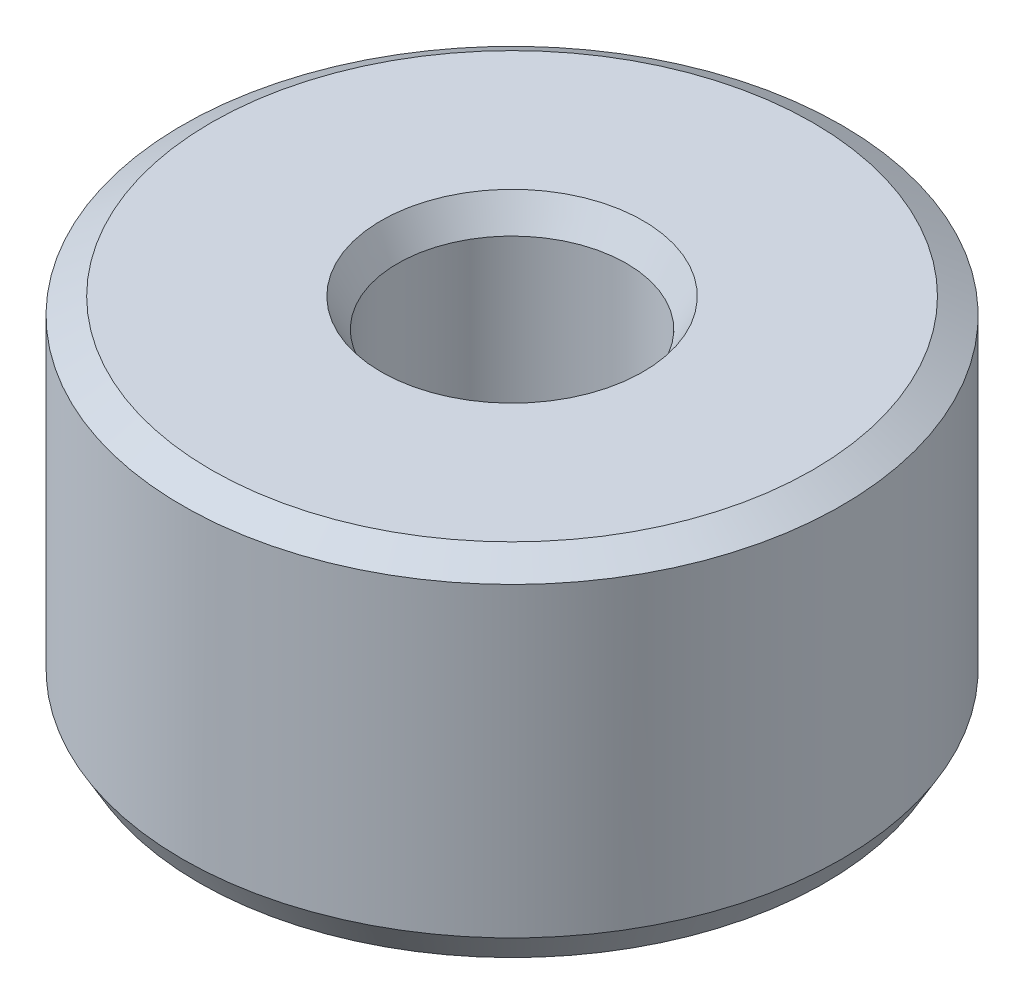
ISO-10303-21;
HEADER;
FILE_DESCRIPTION(('STEP AP214'),'2;1');
FILE_NAME('part.step','',(''),(''),'','','');
FILE_SCHEMA(('AUTOMOTIVE_DESIGN { 1 0 10303 214 1 1 1 1 }'));
ENDSEC;
DATA;
#1=APPLICATION_CONTEXT('core data for automotive mechanical design processes');
#2=APPLICATION_PROTOCOL_DEFINITION('international standard','automotive_design',2000,#1);
#3=PRODUCT_CONTEXT('',#1,'mechanical');
#4=PRODUCT('Part','Part','',(#3));
#5=PRODUCT_RELATED_PRODUCT_CATEGORY('part','',(#4));
#6=PRODUCT_DEFINITION_FORMATION('','',#4);
#7=PRODUCT_DEFINITION_CONTEXT('part definition',#1,'design');
#8=PRODUCT_DEFINITION('design','',#6,#7);
#9=PRODUCT_DEFINITION_SHAPE('','',#8);
#10=(LENGTH_UNIT() NAMED_UNIT(*) SI_UNIT(.MILLI.,.METRE.));
#11=(NAMED_UNIT(*) PLANE_ANGLE_UNIT() SI_UNIT($,.RADIAN.));
#12=(NAMED_UNIT(*) SI_UNIT($,.STERADIAN.) SOLID_ANGLE_UNIT());
#13=UNCERTAINTY_MEASURE_WITH_UNIT(LENGTH_MEASURE(1.E-05),#10,'distance_accuracy_value','');
#14=(GEOMETRIC_REPRESENTATION_CONTEXT(3) GLOBAL_UNCERTAINTY_ASSIGNED_CONTEXT((#13)) GLOBAL_UNIT_ASSIGNED_CONTEXT((#10,
#11,#12)) REPRESENTATION_CONTEXT('',''));
#15=CARTESIAN_POINT('',(0.,0.,0.));
#16=DIRECTION('',(0.,0.,1.));
#17=DIRECTION('',(1.,0.,0.));
#18=AXIS2_PLACEMENT_3D('',#15,#16,#17);
#19=CARTESIAN_POINT('',(0.,13.3304831460371,0.));
#20=DIRECTION('',(0.,-1.,0.));
#21=DIRECTION('',(0.,0.,-1.));
#22=AXIS2_PLACEMENT_3D('',#19,#20,#21);
#23=CYLINDRICAL_SURFACE('',#22,12.5);
#24=CARTESIAN_POINT('',(0.,1.09053149015088,0.));
#25=DIRECTION('',(0.,1.,0.));
#26=DIRECTION('',(0.,0.,1.));
#27=AXIS2_PLACEMENT_3D('',#24,#25,#26);
#28=CIRCLE('',#27,12.5);
#29=CARTESIAN_POINT('',(0.,1.09053149015088,-12.5));
#30=VERTEX_POINT('',#29);
#31=EDGE_CURVE('E10',#30,#30,#28,.T.);
#32=CARTESIAN_POINT('',(0.,12.7008644966388,0.));
#33=DIRECTION('',(0.,1.,0.));
#34=DIRECTION('',(0.,0.,1.));
#35=AXIS2_PLACEMENT_3D('',#32,#33,#34);
#36=CIRCLE('',#35,12.5);
#37=CARTESIAN_POINT('',(0.,12.7008644966388,-12.5));
#38=VERTEX_POINT('',#37);
#39=EDGE_CURVE('E50',#38,#38,#36,.F.);
#40=CARTESIAN_POINT('',(0.,1.09053149015088,-12.5));
#41=CARTESIAN_POINT('',(0.,1.21147245896847,-12.5));
#42=CARTESIAN_POINT('',(0.,1.33241342778605,-12.5));
#43=CARTESIAN_POINT('',(0.,1.57429536542121,-12.5));
#44=CARTESIAN_POINT('',(0.,1.69523633423879,-12.5));
#45=CARTESIAN_POINT('',(0.,1.93711827187396,-12.5));
#46=CARTESIAN_POINT('',(0.,2.05805924069154,-12.5));
#47=CARTESIAN_POINT('',(0.,2.2999411783267,-12.5));
#48=CARTESIAN_POINT('',(0.,2.42088214714429,-12.5));
#49=CARTESIAN_POINT('',(0.,2.66276408477945,-12.5));
#50=CARTESIAN_POINT('',(0.,2.78370505359703,-12.5));
#51=CARTESIAN_POINT('',(0.,3.0255869912322,-12.5));
#52=CARTESIAN_POINT('',(0.,3.14652796004978,-12.5));
#53=CARTESIAN_POINT('',(0.,3.38840989768494,-12.5));
#54=CARTESIAN_POINT('',(0.,3.50935086650253,-12.5));
#55=CARTESIAN_POINT('',(0.,3.75123280413769,-12.5));
#56=CARTESIAN_POINT('',(0.,3.87217377295527,-12.5));
#57=CARTESIAN_POINT('',(0.,4.11405571059044,-12.5));
#58=CARTESIAN_POINT('',(0.,4.23499667940802,-12.5));
#59=CARTESIAN_POINT('',(0.,4.47687861704318,-12.5));
#60=CARTESIAN_POINT('',(0.,4.59781958586076,-12.5));
#61=CARTESIAN_POINT('',(0.,4.83970152349593,-12.5));
#62=CARTESIAN_POINT('',(0.,4.96064249231351,-12.5));
#63=CARTESIAN_POINT('',(0.,5.20252442994867,-12.5));
#64=CARTESIAN_POINT('',(0.,5.32346539876626,-12.5));
#65=CARTESIAN_POINT('',(0.,5.56534733640142,-12.5));
#66=CARTESIAN_POINT('',(0.,5.686288305219,-12.5));
#67=CARTESIAN_POINT('',(0.,5.92817024285416,-12.5));
#68=CARTESIAN_POINT('',(0.,6.04911121167175,-12.5));
#69=CARTESIAN_POINT('',(0.,6.29099314930691,-12.5));
#70=CARTESIAN_POINT('',(0.,6.41193411812449,-12.5));
#71=CARTESIAN_POINT('',(0.,6.65381605575966,-12.5));
#72=CARTESIAN_POINT('',(0.,6.77475702457724,-12.5));
#73=CARTESIAN_POINT('',(0.,7.0166389622124,-12.5));
#74=CARTESIAN_POINT('',(0.,7.13757993102999,-12.5));
#75=CARTESIAN_POINT('',(0.,7.37946186866515,-12.5));
#76=CARTESIAN_POINT('',(0.,7.50040283748273,-12.5));
#77=CARTESIAN_POINT('',(0.,7.7422847751179,-12.5));
#78=CARTESIAN_POINT('',(0.,7.86322574393548,-12.5));
#79=CARTESIAN_POINT('',(0.,8.10510768157064,-12.5));
#80=CARTESIAN_POINT('',(0.,8.22604865038822,-12.5));
#81=CARTESIAN_POINT('',(0.,8.46793058802339,-12.5));
#82=CARTESIAN_POINT('',(0.,8.58887155684097,-12.5));
#83=CARTESIAN_POINT('',(0.,8.83075349447613,-12.5));
#84=CARTESIAN_POINT('',(0.,8.95169446329372,-12.5));
#85=CARTESIAN_POINT('',(0.,9.19357640092888,-12.5));
#86=CARTESIAN_POINT('',(0.,9.31451736974646,-12.5));
#87=CARTESIAN_POINT('',(0.,9.55639930738162,-12.5));
#88=CARTESIAN_POINT('',(0.,9.67734027619921,-12.5));
#89=CARTESIAN_POINT('',(0.,9.91922221383437,-12.5));
#90=CARTESIAN_POINT('',(0.,10.040163182652,-12.5));
#91=CARTESIAN_POINT('',(0.,10.2820451202871,-12.5));
#92=CARTESIAN_POINT('',(0.,10.4029860891047,-12.5));
#93=CARTESIAN_POINT('',(0.,10.6448680267399,-12.5));
#94=CARTESIAN_POINT('',(0.,10.7658089955574,-12.5));
#95=CARTESIAN_POINT('',(0.,11.0076909331926,-12.5));
#96=CARTESIAN_POINT('',(0.,11.1286319020102,-12.5));
#97=CARTESIAN_POINT('',(0.,11.3705138396454,-12.5));
#98=CARTESIAN_POINT('',(0.,11.4914548084629,-12.5));
#99=CARTESIAN_POINT('',(0.,11.7333367460981,-12.5));
#100=CARTESIAN_POINT('',(0.,11.8542777149157,-12.5));
#101=CARTESIAN_POINT('',(0.,12.0961596525508,-12.5));
#102=CARTESIAN_POINT('',(0.,12.2171006213684,-12.5));
#103=CARTESIAN_POINT('',(0.,12.4589825590036,-12.5));
#104=CARTESIAN_POINT('',(0.,12.5799235278212,-12.5));
#105=CARTESIAN_POINT('',(0.,12.7008644966388,-12.5));
#106=B_SPLINE_CURVE_WITH_KNOTS('',3,(#40,#41,#42,#43,#44,#45,#46,#47,#48,#49,#50,#51,#52,#53,
#54,#55,#56,#57,#58,#59,#60,#61,#62,#63,#64,#65,#66,#67,#68,#69,#70,#71,#72,#73,#74,#75,#76,#77,
#78,#79,#80,#81,#82,#83,#84,#85,#86,#87,#88,#89,#90,#91,#92,#93,#94,#95,#96,#97,#98,#99,#100,
#101,#102,#103,#104,#105),.UNSPECIFIED.,.F.,.F.,(4,2,2,2,2,2,2,2,2,2,2,2,2,2,2,2,2,2,2,2,2,2,2,
2,2,2,2,2,2,2,2,2,4),(0.,0.362822906452747,0.725645812905492,1.08846871935824,1.45129162581098,
1.81411453226373,2.17693743871648,2.53976034516922,2.90258325162197,3.26540615807472,
3.62822906452746,3.99105197098021,4.35387487743295,4.7166977838857,5.07952069033844,
5.44234359679119,5.80516650324394,6.16798940969668,6.53081231614943,6.89363522260217,
7.25645812905492,7.61928103550767,7.98210394196041,8.34492684841316,8.7077497548659,
9.07057266131865,9.4333955677714,9.79621847422415,10.1590413806769,10.5218642871296,
10.8846871935824,11.2475101000351,11.6103330064879),.UNSPECIFIED.);
#107=EDGE_CURVE('BSEAM39',#30,#38,#106,.T.);
#108=ORIENTED_EDGE('',*,*,#31,.T.);
#109=ORIENTED_EDGE('',*,*,#39,.T.);
#110=ORIENTED_EDGE('',*,*,#107,.T.);
#111=ORIENTED_EDGE('',*,*,#107,.F.);
#112=EDGE_LOOP('',(#108,#110,#109,#111));
#113=FACE_BOUND('',#112,.T.);
#114=ADVANCED_FACE('F39',(#113),#23,.T.);
#115=CARTESIAN_POINT('',(0.,13.3304831460371,0.));
#116=DIRECTION('',(0.,1.,0.));
#117=DIRECTION('',(0.,0.,1.));
#118=AXIS2_PLACEMENT_3D('',#115,#116,#117);
#119=PLANE('',#118);
#120=CARTESIAN_POINT('',(0.,13.3304831460371,0.));
#121=DIRECTION('',(0.,1.,0.));
#122=DIRECTION('',(0.,0.,1.));
#123=AXIS2_PLACEMENT_3D('',#120,#121,#122);
#124=CIRCLE('',#123,4.96884971457869);
#125=CARTESIAN_POINT('',(0.,13.3304831460371,4.96884971457869));
#126=VERTEX_POINT('',#125);
#127=EDGE_CURVE('E58',#126,#126,#124,.F.);
#128=ORIENTED_EDGE('',*,*,#127,.T.);
#129=EDGE_LOOP('',(#128));
#130=FACE_BOUND('',#129,.T.);
#131=CARTESIAN_POINT('',(0.,13.3304831460371,0.));
#132=DIRECTION('',(0.,1.,0.));
#133=DIRECTION('',(0.,0.,1.));
#134=AXIS2_PLACEMENT_3D('',#131,#132,#133);
#135=CIRCLE('',#134,11.4094685098492);
#136=CARTESIAN_POINT('',(0.,13.3304831460371,11.4094685098492));
#137=VERTEX_POINT('',#136);
#138=EDGE_CURVE('E61',#137,#137,#135,.T.);
#139=ORIENTED_EDGE('',*,*,#138,.T.);
#140=EDGE_LOOP('',(#139));
#141=FACE_BOUND('',#140,.T.);
#142=ADVANCED_FACE('F88',(#130,#141),#119,.T.);
#143=CARTESIAN_POINT('',(0.,0.,0.));
#144=DIRECTION('',(0.,1.,0.));
#145=DIRECTION('',(0.,0.,1.));
#146=AXIS2_PLACEMENT_3D('',#143,#144,#145);
#147=PLANE('',#146);
#148=CARTESIAN_POINT('',(0.,0.,0.));
#149=DIRECTION('',(0.,1.,0.));
#150=DIRECTION('',(0.,0.,1.));
#151=AXIS2_PLACEMENT_3D('',#148,#149,#150);
#152=CIRCLE('',#151,5.42976255533114);
#153=CARTESIAN_POINT('',(0.,0.,5.42976255533114));
#154=VERTEX_POINT('',#153);
#155=EDGE_CURVE('E51',#154,#154,#152,.T.);
#156=ORIENTED_EDGE('',*,*,#155,.T.);
#157=EDGE_LOOP('',(#156));
#158=FACE_BOUND('',#157,.T.);
#159=CARTESIAN_POINT('',(0.,0.,0.));
#160=DIRECTION('',(0.,1.,0.));
#161=DIRECTION('',(0.,0.,1.));
#162=AXIS2_PLACEMENT_3D('',#159,#160,#161);
#163=CIRCLE('',#162,11.8703813506016);
#164=CARTESIAN_POINT('',(0.,0.,11.8703813506016));
#165=VERTEX_POINT('',#164);
#166=EDGE_CURVE('E54',#165,#165,#163,.F.);
#167=ORIENTED_EDGE('',*,*,#166,.T.);
#168=EDGE_LOOP('',(#167));
#169=FACE_BOUND('',#168,.T.);
#170=ADVANCED_FACE('F83',(#158,#169),#147,.F.);
#171=CARTESIAN_POINT('',(0.,13.3304831460371,0.));
#172=DIRECTION('',(0.,-1.,0.));
#173=DIRECTION('',(0.,0.,-1.));
#174=AXIS2_PLACEMENT_3D('',#171,#172,#173);
#175=CYLINDRICAL_SURFACE('',#174,4.33923106518032);
#176=CARTESIAN_POINT('',(0.,12.2399516558862,0.));
#177=DIRECTION('',(0.,1.,0.));
#178=DIRECTION('',(0.,0.,1.));
#179=AXIS2_PLACEMENT_3D('',#176,#177,#178);
#180=CIRCLE('',#179,4.33923106518032);
#181=CARTESIAN_POINT('',(0.,12.2399516558862,-4.33923106518032));
#182=VERTEX_POINT('',#181);
#183=EDGE_CURVE('E67',#182,#182,#180,.T.);
#184=CARTESIAN_POINT('',(0.,0.629618649398337,0.));
#185=DIRECTION('',(0.,1.,0.));
#186=DIRECTION('',(0.,0.,1.));
#187=AXIS2_PLACEMENT_3D('',#184,#185,#186);
#188=CIRCLE('',#187,4.33923106518032);
#189=CARTESIAN_POINT('',(0.,0.629618649398336,-4.33923106518032));
#190=VERTEX_POINT('',#189);
#191=EDGE_CURVE('E69',#190,#190,#188,.F.);
#192=CARTESIAN_POINT('',(0.,12.2399516558862,-4.33923106518032));
#193=CARTESIAN_POINT('',(0.,12.1190106870687,-4.33923106518032));
#194=CARTESIAN_POINT('',(0.,11.9980697182511,-4.33923106518032));
#195=CARTESIAN_POINT('',(0.,11.7561877806159,-4.33923106518032));
#196=CARTESIAN_POINT('',(0.,11.6352468117983,-4.33923106518032));
#197=CARTESIAN_POINT('',(0.,11.3933648741632,-4.33923106518032));
#198=CARTESIAN_POINT('',(0.,11.2724239053456,-4.33923106518032));
#199=CARTESIAN_POINT('',(0.,11.0305419677104,-4.33923106518032));
#200=CARTESIAN_POINT('',(0.,10.9096009988928,-4.33923106518032));
#201=CARTESIAN_POINT('',(0.,10.6677190612577,-4.33923106518032));
#202=CARTESIAN_POINT('',(0.,10.5467780924401,-4.33923106518032));
#203=CARTESIAN_POINT('',(0.,10.3048961548049,-4.33923106518032));
#204=CARTESIAN_POINT('',(0.,10.1839551859873,-4.33923106518032));
#205=CARTESIAN_POINT('',(0.,9.94207324835217,-4.33923106518032));
#206=CARTESIAN_POINT('',(0.,9.82113227953459,-4.33923106518032));
#207=CARTESIAN_POINT('',(0.,9.57925034189943,-4.33923106518032));
#208=CARTESIAN_POINT('',(0.,9.45830937308184,-4.33923106518032));
#209=CARTESIAN_POINT('',(0.,9.21642743544668,-4.33923106518032));
#210=CARTESIAN_POINT('',(0.,9.0954864666291,-4.33923106518032));
#211=CARTESIAN_POINT('',(0.,8.85360452899393,-4.33923106518032));
#212=CARTESIAN_POINT('',(0.,8.73266356017635,-4.33923106518032));
#213=CARTESIAN_POINT('',(0.,8.49078162254119,-4.33923106518032));
#214=CARTESIAN_POINT('',(0.,8.3698406537236,-4.33923106518032));
#215=CARTESIAN_POINT('',(0.,8.12795871608844,-4.33923106518032));
#216=CARTESIAN_POINT('',(0.,8.00701774727086,-4.33923106518032));
#217=CARTESIAN_POINT('',(0.,7.76513580963569,-4.33923106518032));
#218=CARTESIAN_POINT('',(0.,7.64419484081811,-4.33923106518032));
#219=CARTESIAN_POINT('',(0.,7.40231290318294,-4.33923106518032));
#220=CARTESIAN_POINT('',(0.,7.28137193436536,-4.33923106518032));
#221=CARTESIAN_POINT('',(0.,7.0394899967302,-4.33923106518032));
#222=CARTESIAN_POINT('',(0.,6.91854902791261,-4.33923106518032));
#223=CARTESIAN_POINT('',(0.,6.67666709027745,-4.33923106518032));
#224=CARTESIAN_POINT('',(0.,6.55572612145987,-4.33923106518032));
#225=CARTESIAN_POINT('',(0.,6.3138441838247,-4.33923106518032));
#226=CARTESIAN_POINT('',(0.,6.19290321500712,-4.33923106518032));
#227=CARTESIAN_POINT('',(0.,5.95102127737196,-4.33923106518032));
#228=CARTESIAN_POINT('',(0.,5.83008030855437,-4.33923106518032));
#229=CARTESIAN_POINT('',(0.,5.58819837091921,-4.33923106518032));
#230=CARTESIAN_POINT('',(0.,5.46725740210163,-4.33923106518032));
#231=CARTESIAN_POINT('',(0.,5.22537546446646,-4.33923106518032));
#232=CARTESIAN_POINT('',(0.,5.10443449564888,-4.33923106518032));
#233=CARTESIAN_POINT('',(0.,4.86255255801372,-4.33923106518032));
#234=CARTESIAN_POINT('',(0.,4.74161158919613,-4.33923106518032));
#235=CARTESIAN_POINT('',(0.,4.49972965156097,-4.33923106518032));
#236=CARTESIAN_POINT('',(0.,4.37878868274339,-4.33923106518032));
#237=CARTESIAN_POINT('',(0.,4.13690674510822,-4.33923106518032));
#238=CARTESIAN_POINT('',(0.,4.01596577629064,-4.33923106518032));
#239=CARTESIAN_POINT('',(0.,3.77408383865548,-4.33923106518032));
#240=CARTESIAN_POINT('',(0.,3.65314286983789,-4.33923106518032));
#241=CARTESIAN_POINT('',(0.,3.41126093220273,-4.33923106518032));
#242=CARTESIAN_POINT('',(0.,3.29031996338515,-4.33923106518032));
#243=CARTESIAN_POINT('',(0.,3.04843802574998,-4.33923106518032));
#244=CARTESIAN_POINT('',(0.,2.9274970569324,-4.33923106518032));
#245=CARTESIAN_POINT('',(0.,2.68561511929723,-4.33923106518032));
#246=CARTESIAN_POINT('',(0.,2.56467415047965,-4.33923106518032));
#247=CARTESIAN_POINT('',(0.,2.32279221284449,-4.33923106518032));
#248=CARTESIAN_POINT('',(0.,2.20185124402691,-4.33923106518032));
#249=CARTESIAN_POINT('',(0.,1.95996930639174,-4.33923106518032));
#250=CARTESIAN_POINT('',(0.,1.83902833757416,-4.33923106518032));
#251=CARTESIAN_POINT('',(0.,1.59714639993899,-4.33923106518032));
#252=CARTESIAN_POINT('',(0.,1.47620543112141,-4.33923106518032));
#253=CARTESIAN_POINT('',(0.,1.23432349348625,-4.33923106518032));
#254=CARTESIAN_POINT('',(0.,1.11338252466866,-4.33923106518032));
#255=CARTESIAN_POINT('',(0.,0.871500587033499,-4.33923106518032));
#256=CARTESIAN_POINT('',(0.,0.750559618215917,-4.33923106518032));
#257=CARTESIAN_POINT('',(0.,0.629618649398336,-4.33923106518032));
#258=B_SPLINE_CURVE_WITH_KNOTS('',3,(#192,#193,#194,#195,#196,#197,#198,#199,#200,#201,#202,
#203,#204,#205,#206,#207,#208,#209,#210,#211,#212,#213,#214,#215,#216,#217,#218,#219,#220,#221,
#222,#223,#224,#225,#226,#227,#228,#229,#230,#231,#232,#233,#234,#235,#236,#237,#238,#239,#240,
#241,#242,#243,#244,#245,#246,#247,#248,#249,#250,#251,#252,#253,#254,#255,#256,#257),
.UNSPECIFIED.,.F.,.F.,(4,2,2,2,2,2,2,2,2,2,2,2,2,2,2,2,2,2,2,2,2,2,2,2,2,2,2,2,2,2,2,2,4),(0.,
0.362822906452748,0.725645812905495,1.08846871935824,1.45129162581099,1.81411453226374,
2.17693743871648,2.53976034516923,2.90258325162198,3.26540615807472,3.62822906452747,
3.99105197098022,4.35387487743296,4.71669778388571,5.07952069033846,5.44234359679121,
5.80516650324395,6.1679894096967,6.53081231614945,6.89363522260219,7.25645812905494,
7.61928103550769,7.98210394196043,8.34492684841318,8.70774975486593,9.07057266131867,
9.43339556777142,9.79621847422417,10.1590413806769,10.5218642871297,10.8846871935824,
11.2475101000352,11.6103330064879),.UNSPECIFIED.);
#259=EDGE_CURVE('BSEAM71',#182,#190,#258,.T.);
#260=ORIENTED_EDGE('',*,*,#183,.T.);
#261=ORIENTED_EDGE('',*,*,#191,.T.);
#262=ORIENTED_EDGE('',*,*,#259,.T.);
#263=ORIENTED_EDGE('',*,*,#259,.F.);
#264=EDGE_LOOP('',(#260,#262,#261,#263));
#265=FACE_BOUND('',#264,.T.);
#266=ADVANCED_FACE('F71',(#265),#175,.F.);
#267=CARTESIAN_POINT('',(0.,12.2399516558862,0.));
#268=DIRECTION('',(0.,1.,0.));
#269=DIRECTION('',(0.,0.,1.));
#270=AXIS2_PLACEMENT_3D('',#267,#268,#269);
#271=CONICAL_SURFACE('',#270,4.33923106518032,0.523598775598303);
#272=ORIENTED_EDGE('',*,*,#127,.F.);
#273=EDGE_LOOP('',(#272));
#274=FACE_BOUND('',#273,.T.);
#275=ORIENTED_EDGE('',*,*,#183,.F.);
#276=EDGE_LOOP('',(#275));
#277=FACE_BOUND('',#276,.T.);
#278=ADVANCED_FACE('F77',(#274,#277),#271,.F.);
#279=CARTESIAN_POINT('',(0.,0.,0.));
#280=DIRECTION('',(0.,-1.,0.));
#281=DIRECTION('',(0.,0.,-1.));
#282=AXIS2_PLACEMENT_3D('',#279,#280,#281);
#283=CONICAL_SURFACE('',#282,5.42976255533114,1.0471975511966);
#284=ORIENTED_EDGE('',*,*,#191,.F.);
#285=EDGE_LOOP('',(#284));
#286=FACE_BOUND('',#285,.T.);
#287=ORIENTED_EDGE('',*,*,#155,.F.);
#288=EDGE_LOOP('',(#287));
#289=FACE_BOUND('',#288,.T.);
#290=ADVANCED_FACE('F73',(#286,#289),#283,.F.);
#291=CARTESIAN_POINT('',(0.,1.09053149015088,0.));
#292=DIRECTION('',(0.,1.,0.));
#293=DIRECTION('',(0.,0.,1.));
#294=AXIS2_PLACEMENT_3D('',#291,#292,#293);
#295=CONICAL_SURFACE('',#294,12.5,0.523598775598302);
#296=ORIENTED_EDGE('',*,*,#166,.F.);
#297=EDGE_LOOP('',(#296));
#298=FACE_BOUND('',#297,.T.);
#299=ORIENTED_EDGE('',*,*,#31,.F.);
#300=EDGE_LOOP('',(#299));
#301=FACE_BOUND('',#300,.T.);
#302=ADVANCED_FACE('F76',(#298,#301),#295,.T.);
#303=CARTESIAN_POINT('',(0.,13.3304831460371,0.));
#304=DIRECTION('',(0.,-1.,0.));
#305=DIRECTION('',(0.,0.,-1.));
#306=AXIS2_PLACEMENT_3D('',#303,#304,#305);
#307=CONICAL_SURFACE('',#306,11.4094685098492,1.0471975511966);
#308=ORIENTED_EDGE('',*,*,#39,.F.);
#309=EDGE_LOOP('',(#308));
#310=FACE_BOUND('',#309,.T.);
#311=ORIENTED_EDGE('',*,*,#138,.F.);
#312=EDGE_LOOP('',(#311));
#313=FACE_BOUND('',#312,.T.);
#314=ADVANCED_FACE('F45',(#310,#313),#307,.T.);
#315=CLOSED_SHELL('',(#114,#142,#170,#266,#278,#290,#302,#314));
#316=MANIFOLD_SOLID_BREP('B2',#315);
#317=ADVANCED_BREP_SHAPE_REPRESENTATION('',(#18,#316),#14);
#318=SHAPE_DEFINITION_REPRESENTATION(#9,#317);
ENDSEC;
END-ISO-10303-21;
